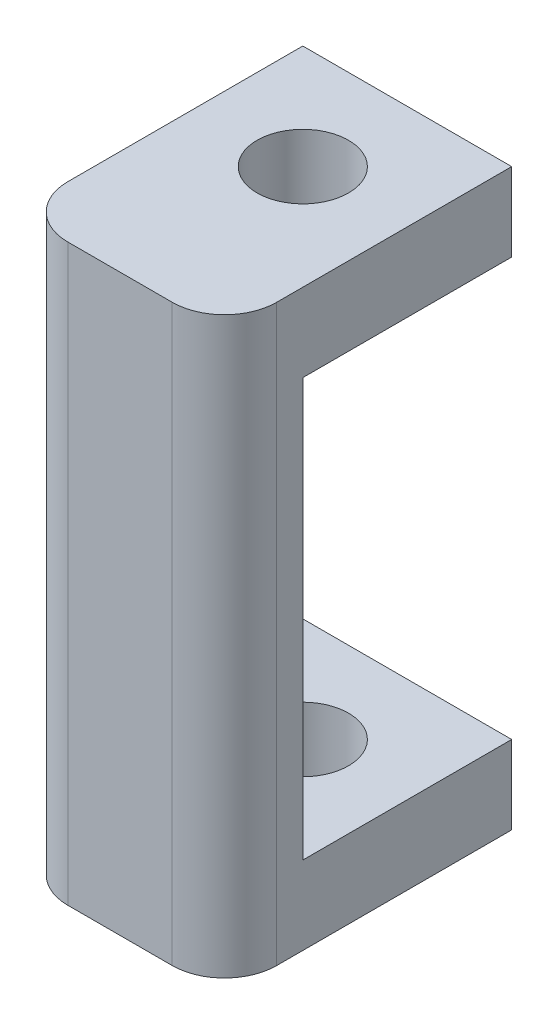
ISO-10303-21;
HEADER;
FILE_DESCRIPTION(('STEP AP214'),'2;1');
FILE_NAME('part.step','',(''),(''),'','','');
FILE_SCHEMA(('AUTOMOTIVE_DESIGN { 1 0 10303 214 1 1 1 1 }'));
ENDSEC;
DATA;
#1=APPLICATION_CONTEXT('core data for automotive mechanical design processes');
#2=APPLICATION_PROTOCOL_DEFINITION('international standard','automotive_design',2000,#1);
#3=PRODUCT_CONTEXT('',#1,'mechanical');
#4=PRODUCT('Part','Part','',(#3));
#5=PRODUCT_RELATED_PRODUCT_CATEGORY('part','',(#4));
#6=PRODUCT_DEFINITION_FORMATION('','',#4);
#7=PRODUCT_DEFINITION_CONTEXT('part definition',#1,'design');
#8=PRODUCT_DEFINITION('design','',#6,#7);
#9=PRODUCT_DEFINITION_SHAPE('','',#8);
#10=(LENGTH_UNIT() NAMED_UNIT(*) SI_UNIT(.MILLI.,.METRE.));
#11=(NAMED_UNIT(*) PLANE_ANGLE_UNIT() SI_UNIT($,.RADIAN.));
#12=(NAMED_UNIT(*) SI_UNIT($,.STERADIAN.) SOLID_ANGLE_UNIT());
#13=UNCERTAINTY_MEASURE_WITH_UNIT(LENGTH_MEASURE(1.E-05),#10,'distance_accuracy_value','');
#14=(GEOMETRIC_REPRESENTATION_CONTEXT(3) GLOBAL_UNCERTAINTY_ASSIGNED_CONTEXT((#13)) GLOBAL_UNIT_ASSIGNED_CONTEXT((#10,
#11,#12)) REPRESENTATION_CONTEXT('',''));
#15=CARTESIAN_POINT('',(0.,0.,0.));
#16=DIRECTION('',(0.,0.,1.));
#17=DIRECTION('',(1.,0.,0.));
#18=AXIS2_PLACEMENT_3D('',#15,#16,#17);
#19=CARTESIAN_POINT('',(0.,3.,0.));
#20=DIRECTION('',(0.,0.,-1.));
#21=DIRECTION('',(-1.,0.,0.));
#22=AXIS2_PLACEMENT_3D('',#19,#20,#21);
#23=PLANE('',#22);
#24=DIRECTION('',(1.,0.,0.));
#25=VECTOR('',#24,1.);
#26=CARTESIAN_POINT('',(0.,0.,0.));
#27=LINE('',#26,#25);
#28=CARTESIAN_POINT('',(0.,0.,0.));
#29=VERTEX_POINT('',#28);
#30=CARTESIAN_POINT('',(8.,0.,0.));
#31=VERTEX_POINT('',#30);
#32=EDGE_CURVE('E85',#29,#31,#27,.T.);
#33=ORIENTED_EDGE('',*,*,#32,.F.);
#34=DIRECTION('',(0.,-1.,0.));
#35=VECTOR('',#34,1.);
#36=CARTESIAN_POINT('',(0.,3.,0.));
#37=LINE('',#36,#35);
#38=CARTESIAN_POINT('',(0.,3.,0.));
#39=VERTEX_POINT('',#38);
#40=EDGE_CURVE('E11',#39,#29,#37,.T.);
#41=ORIENTED_EDGE('',*,*,#40,.F.);
#42=DIRECTION('',(1.,0.,0.));
#43=VECTOR('',#42,1.);
#44=CARTESIAN_POINT('',(0.,3.,0.));
#45=LINE('',#44,#43);
#46=CARTESIAN_POINT('',(8.,3.,0.));
#47=VERTEX_POINT('',#46);
#48=EDGE_CURVE('E88',#39,#47,#45,.T.);
#49=ORIENTED_EDGE('',*,*,#48,.T.);
#50=DIRECTION('',(0.,-1.,0.));
#51=VECTOR('',#50,1.);
#52=CARTESIAN_POINT('',(8.,3.,0.));
#53=LINE('',#52,#51);
#54=EDGE_CURVE('E60',#47,#31,#53,.T.);
#55=ORIENTED_EDGE('',*,*,#54,.T.);
#56=EDGE_LOOP('',(#33,#41,#49,#55));
#57=FACE_BOUND('',#56,.T.);
#58=ADVANCED_FACE('F37',(#57),#23,.T.);
#59=CARTESIAN_POINT('',(0.,3.,0.));
#60=DIRECTION('',(-1.,0.,0.));
#61=DIRECTION('',(0.,0.,1.));
#62=AXIS2_PLACEMENT_3D('',#59,#60,#61);
#63=PLANE('',#62);
#64=DIRECTION('',(0.,0.,-1.));
#65=VECTOR('',#64,1.);
#66=CARTESIAN_POINT('',(0.,0.,0.));
#67=LINE('',#66,#65);
#68=CARTESIAN_POINT('',(0.,0.,8.99999999999999));
#69=VERTEX_POINT('',#68);
#70=EDGE_CURVE('E98',#69,#29,#67,.T.);
#71=ORIENTED_EDGE('',*,*,#70,.F.);
#72=DIRECTION('',(0.,-1.,0.));
#73=VECTOR('',#72,1.);
#74=CARTESIAN_POINT('',(0.,3.,8.99999999999999));
#75=LINE('',#74,#73);
#76=CARTESIAN_POINT('',(0.,22.,8.99999999999999));
#77=VERTEX_POINT('',#76);
#78=EDGE_CURVE('E45',#77,#69,#75,.T.);
#79=ORIENTED_EDGE('',*,*,#78,.F.);
#80=DIRECTION('',(0.,0.,1.));
#81=VECTOR('',#80,1.);
#82=CARTESIAN_POINT('',(0.,22.,8.));
#83=LINE('',#82,#81);
#84=CARTESIAN_POINT('',(0.,22.,0.));
#85=VERTEX_POINT('',#84);
#86=EDGE_CURVE('E153',#85,#77,#83,.T.);
#87=ORIENTED_EDGE('',*,*,#86,.F.);
#88=DIRECTION('',(0.,-1.,0.));
#89=VECTOR('',#88,1.);
#90=CARTESIAN_POINT('',(0.,22.,0.));
#91=LINE('',#90,#89);
#92=CARTESIAN_POINT('',(0.,19.,0.));
#93=VERTEX_POINT('',#92);
#94=EDGE_CURVE('E155',#85,#93,#91,.T.);
#95=ORIENTED_EDGE('',*,*,#94,.T.);
#96=DIRECTION('',(0.,0.,1.));
#97=VECTOR('',#96,1.);
#98=CARTESIAN_POINT('',(0.,19.,8.));
#99=LINE('',#98,#97);
#100=CARTESIAN_POINT('',(0.,19.,8.));
#101=VERTEX_POINT('',#100);
#102=EDGE_CURVE('E168',#93,#101,#99,.T.);
#103=ORIENTED_EDGE('',*,*,#102,.T.);
#104=DIRECTION('',(0.,-1.,0.));
#105=VECTOR('',#104,1.);
#106=CARTESIAN_POINT('',(0.,19.,8.));
#107=LINE('',#106,#105);
#108=CARTESIAN_POINT('',(0.,3.,8.));
#109=VERTEX_POINT('',#108);
#110=EDGE_CURVE('E180',#101,#109,#107,.T.);
#111=ORIENTED_EDGE('',*,*,#110,.T.);
#112=DIRECTION('',(0.,0.,-1.));
#113=VECTOR('',#112,1.);
#114=CARTESIAN_POINT('',(0.,3.,0.));
#115=LINE('',#114,#113);
#116=EDGE_CURVE('E188',#109,#39,#115,.T.);
#117=ORIENTED_EDGE('',*,*,#116,.T.);
#118=ORIENTED_EDGE('',*,*,#40,.T.);
#119=EDGE_LOOP('',(#71,#79,#87,#95,#103,#111,#117,#118));
#120=FACE_BOUND('',#119,.T.);
#121=ADVANCED_FACE('F135',(#120),#63,.T.);
#122=CARTESIAN_POINT('',(2.,3.,9.));
#123=DIRECTION('',(0.,-1.,0.));
#124=DIRECTION('',(0.,0.,-1.));
#125=AXIS2_PLACEMENT_3D('',#122,#123,#124);
#126=CYLINDRICAL_SURFACE('',#125,2.);
#127=CARTESIAN_POINT('',(2.,0.,9.));
#128=DIRECTION('',(0.,1.,0.));
#129=DIRECTION('',(0.,0.,1.));
#130=AXIS2_PLACEMENT_3D('',#127,#128,#129);
#131=CIRCLE('',#130,2.);
#132=CARTESIAN_POINT('',(2.00000000000001,0.,11.));
#133=VERTEX_POINT('',#132);
#134=EDGE_CURVE('E126',#69,#133,#131,.T.);
#135=ORIENTED_EDGE('',*,*,#134,.T.);
#136=DIRECTION('',(0.,-1.,0.));
#137=VECTOR('',#136,1.);
#138=CARTESIAN_POINT('',(2.00000000000001,3.,11.));
#139=LINE('',#138,#137);
#140=CARTESIAN_POINT('',(2.,22.,11.));
#141=VERTEX_POINT('',#140);
#142=EDGE_CURVE('E118',#141,#133,#139,.T.);
#143=ORIENTED_EDGE('',*,*,#142,.F.);
#144=CARTESIAN_POINT('',(2.,22.,9.));
#145=DIRECTION('',(0.,1.,0.));
#146=DIRECTION('',(0.,0.,1.));
#147=AXIS2_PLACEMENT_3D('',#144,#145,#146);
#148=CIRCLE('',#147,2.);
#149=EDGE_CURVE('E129',#77,#141,#148,.T.);
#150=ORIENTED_EDGE('',*,*,#149,.F.);
#151=ORIENTED_EDGE('',*,*,#78,.T.);
#152=EDGE_LOOP('',(#135,#143,#150,#151));
#153=FACE_BOUND('',#152,.T.);
#154=ADVANCED_FACE('F124',(#153),#126,.T.);
#155=CARTESIAN_POINT('',(0.,3.,11.));
#156=DIRECTION('',(0.,0.,-1.));
#157=DIRECTION('',(-1.,0.,0.));
#158=AXIS2_PLACEMENT_3D('',#155,#156,#157);
#159=PLANE('',#158);
#160=DIRECTION('',(1.,0.,0.));
#161=VECTOR('',#160,1.);
#162=CARTESIAN_POINT('',(0.,0.,11.));
#163=LINE('',#162,#161);
#164=CARTESIAN_POINT('',(5.99999999999999,0.,11.));
#165=VERTEX_POINT('',#164);
#166=EDGE_CURVE('E110',#133,#165,#163,.T.);
#167=ORIENTED_EDGE('',*,*,#166,.T.);
#168=DIRECTION('',(0.,-1.,0.));
#169=VECTOR('',#168,1.);
#170=CARTESIAN_POINT('',(5.99999999999999,3.,11.));
#171=LINE('',#170,#169);
#172=CARTESIAN_POINT('',(5.99999999999999,22.,11.));
#173=VERTEX_POINT('',#172);
#174=EDGE_CURVE('E115',#173,#165,#171,.T.);
#175=ORIENTED_EDGE('',*,*,#174,.F.);
#176=DIRECTION('',(1.,0.,0.));
#177=VECTOR('',#176,1.);
#178=CARTESIAN_POINT('',(2.,22.,11.));
#179=LINE('',#178,#177);
#180=EDGE_CURVE('E145',#141,#173,#179,.T.);
#181=ORIENTED_EDGE('',*,*,#180,.F.);
#182=ORIENTED_EDGE('',*,*,#142,.T.);
#183=EDGE_LOOP('',(#167,#175,#181,#182));
#184=FACE_BOUND('',#183,.T.);
#185=ADVANCED_FACE('F140',(#184),#159,.F.);
#186=CARTESIAN_POINT('',(6.,3.,9.));
#187=DIRECTION('',(0.,-1.,0.));
#188=DIRECTION('',(0.,0.,-1.));
#189=AXIS2_PLACEMENT_3D('',#186,#187,#188);
#190=CYLINDRICAL_SURFACE('',#189,2.);
#191=CARTESIAN_POINT('',(6.,0.,9.));
#192=DIRECTION('',(0.,1.,0.));
#193=DIRECTION('',(0.,0.,1.));
#194=AXIS2_PLACEMENT_3D('',#191,#192,#193);
#195=CIRCLE('',#194,2.);
#196=CARTESIAN_POINT('',(8.,0.,8.99999999999999));
#197=VERTEX_POINT('',#196);
#198=EDGE_CURVE('E106',#165,#197,#195,.T.);
#199=ORIENTED_EDGE('',*,*,#198,.T.);
#200=DIRECTION('',(0.,-1.,0.));
#201=VECTOR('',#200,1.);
#202=CARTESIAN_POINT('',(8.,3.,8.99999999999999));
#203=LINE('',#202,#201);
#204=CARTESIAN_POINT('',(8.,22.,8.99999999999999));
#205=VERTEX_POINT('',#204);
#206=EDGE_CURVE('E89',#205,#197,#203,.T.);
#207=ORIENTED_EDGE('',*,*,#206,.F.);
#208=CARTESIAN_POINT('',(6.,22.,9.));
#209=DIRECTION('',(0.,1.,0.));
#210=DIRECTION('',(0.,0.,1.));
#211=AXIS2_PLACEMENT_3D('',#208,#209,#210);
#212=CIRCLE('',#211,2.);
#213=EDGE_CURVE('E171',#173,#205,#212,.T.);
#214=ORIENTED_EDGE('',*,*,#213,.F.);
#215=ORIENTED_EDGE('',*,*,#174,.T.);
#216=EDGE_LOOP('',(#199,#207,#214,#215));
#217=FACE_BOUND('',#216,.T.);
#218=ADVANCED_FACE('F195',(#217),#190,.T.);
#219=CARTESIAN_POINT('',(4.,3.,4.));
#220=DIRECTION('',(0.,-1.,0.));
#221=DIRECTION('',(0.,0.,-1.));
#222=AXIS2_PLACEMENT_3D('',#219,#220,#221);
#223=CYLINDRICAL_SURFACE('',#222,1.75);
#224=CARTESIAN_POINT('',(4.,3.,4.));
#225=DIRECTION('',(0.,1.,0.));
#226=DIRECTION('',(0.,0.,1.));
#227=AXIS2_PLACEMENT_3D('',#224,#225,#226);
#228=CIRCLE('',#227,1.75);
#229=CARTESIAN_POINT('',(4.,3.,5.75));
#230=VERTEX_POINT('',#229);
#231=EDGE_CURVE('E105',#230,#230,#228,.T.);
#232=ORIENTED_EDGE('',*,*,#231,.T.);
#233=EDGE_LOOP('',(#232));
#234=FACE_BOUND('',#233,.T.);
#235=CARTESIAN_POINT('',(4.,0.,4.));
#236=DIRECTION('',(0.,1.,0.));
#237=DIRECTION('',(0.,0.,1.));
#238=AXIS2_PLACEMENT_3D('',#235,#236,#237);
#239=CIRCLE('',#238,1.75);
#240=CARTESIAN_POINT('',(4.,0.,5.75));
#241=VERTEX_POINT('',#240);
#242=EDGE_CURVE('E99',#241,#241,#239,.T.);
#243=ORIENTED_EDGE('',*,*,#242,.F.);
#244=EDGE_LOOP('',(#243));
#245=FACE_BOUND('',#244,.T.);
#246=ADVANCED_FACE('F39',(#234,#245),#223,.F.);
#247=CARTESIAN_POINT('',(8.,3.,0.));
#248=DIRECTION('',(1.,0.,0.));
#249=DIRECTION('',(0.,0.,-1.));
#250=AXIS2_PLACEMENT_3D('',#247,#248,#249);
#251=PLANE('',#250);
#252=DIRECTION('',(0.,0.,1.));
#253=VECTOR('',#252,1.);
#254=CARTESIAN_POINT('',(8.,0.,0.));
#255=LINE('',#254,#253);
#256=EDGE_CURVE('E95',#31,#197,#255,.T.);
#257=ORIENTED_EDGE('',*,*,#256,.F.);
#258=ORIENTED_EDGE('',*,*,#54,.F.);
#259=DIRECTION('',(0.,0.,1.));
#260=VECTOR('',#259,1.);
#261=CARTESIAN_POINT('',(8.,3.,0.));
#262=LINE('',#261,#260);
#263=CARTESIAN_POINT('',(8.,3.,8.));
#264=VERTEX_POINT('',#263);
#265=EDGE_CURVE('E90',#47,#264,#262,.T.);
#266=ORIENTED_EDGE('',*,*,#265,.T.);
#267=DIRECTION('',(0.,-1.,0.));
#268=VECTOR('',#267,1.);
#269=CARTESIAN_POINT('',(8.,19.,8.));
#270=LINE('',#269,#268);
#271=CARTESIAN_POINT('',(8.,19.,8.));
#272=VERTEX_POINT('',#271);
#273=EDGE_CURVE('E184',#272,#264,#270,.T.);
#274=ORIENTED_EDGE('',*,*,#273,.F.);
#275=DIRECTION('',(0.,0.,-1.));
#276=VECTOR('',#275,1.);
#277=CARTESIAN_POINT('',(8.,19.,0.));
#278=LINE('',#277,#276);
#279=CARTESIAN_POINT('',(8.,19.,0.));
#280=VERTEX_POINT('',#279);
#281=EDGE_CURVE('E161',#272,#280,#278,.T.);
#282=ORIENTED_EDGE('',*,*,#281,.T.);
#283=DIRECTION('',(0.,-1.,0.));
#284=VECTOR('',#283,1.);
#285=CARTESIAN_POINT('',(8.,22.,0.));
#286=LINE('',#285,#284);
#287=CARTESIAN_POINT('',(8.,22.,0.));
#288=VERTEX_POINT('',#287);
#289=EDGE_CURVE('E174',#288,#280,#286,.T.);
#290=ORIENTED_EDGE('',*,*,#289,.F.);
#291=DIRECTION('',(0.,0.,-1.));
#292=VECTOR('',#291,1.);
#293=CARTESIAN_POINT('',(8.,22.,8.99999999999999));
#294=LINE('',#293,#292);
#295=EDGE_CURVE('E248',#205,#288,#294,.T.);
#296=ORIENTED_EDGE('',*,*,#295,.F.);
#297=ORIENTED_EDGE('',*,*,#206,.T.);
#298=EDGE_LOOP('',(#257,#258,#266,#274,#282,#290,#296,#297));
#299=FACE_BOUND('',#298,.T.);
#300=ADVANCED_FACE('F101',(#299),#251,.T.);
#301=CARTESIAN_POINT('',(0.,3.,0.));
#302=DIRECTION('',(0.,1.,0.));
#303=DIRECTION('',(0.,0.,1.));
#304=AXIS2_PLACEMENT_3D('',#301,#302,#303);
#305=PLANE('',#304);
#306=DIRECTION('',(-1.,0.,0.));
#307=VECTOR('',#306,1.);
#308=CARTESIAN_POINT('',(8.,3.,8.));
#309=LINE('',#308,#307);
#310=EDGE_CURVE('E52',#264,#109,#309,.T.);
#311=ORIENTED_EDGE('',*,*,#310,.F.);
#312=ORIENTED_EDGE('',*,*,#265,.F.);
#313=ORIENTED_EDGE('',*,*,#48,.F.);
#314=ORIENTED_EDGE('',*,*,#116,.F.);
#315=EDGE_LOOP('',(#311,#312,#313,#314));
#316=FACE_BOUND('',#315,.T.);
#317=ORIENTED_EDGE('',*,*,#231,.F.);
#318=EDGE_LOOP('',(#317));
#319=FACE_BOUND('',#318,.T.);
#320=ADVANCED_FACE('F201',(#316,#319),#305,.T.);
#321=CARTESIAN_POINT('',(0.,0.,0.));
#322=DIRECTION('',(0.,1.,0.));
#323=DIRECTION('',(0.,0.,1.));
#324=AXIS2_PLACEMENT_3D('',#321,#322,#323);
#325=PLANE('',#324);
#326=ORIENTED_EDGE('',*,*,#242,.T.);
#327=EDGE_LOOP('',(#326));
#328=FACE_BOUND('',#327,.T.);
#329=ORIENTED_EDGE('',*,*,#32,.T.);
#330=ORIENTED_EDGE('',*,*,#256,.T.);
#331=ORIENTED_EDGE('',*,*,#198,.F.);
#332=ORIENTED_EDGE('',*,*,#166,.F.);
#333=ORIENTED_EDGE('',*,*,#134,.F.);
#334=ORIENTED_EDGE('',*,*,#70,.T.);
#335=EDGE_LOOP('',(#329,#330,#331,#332,#333,#334));
#336=FACE_BOUND('',#335,.T.);
#337=ADVANCED_FACE('F94',(#328,#336),#325,.F.);
#338=CARTESIAN_POINT('',(8.,19.,8.));
#339=DIRECTION('',(0.,0.,1.));
#340=DIRECTION('',(1.,0.,0.));
#341=AXIS2_PLACEMENT_3D('',#338,#339,#340);
#342=PLANE('',#341);
#343=ORIENTED_EDGE('',*,*,#310,.T.);
#344=ORIENTED_EDGE('',*,*,#110,.F.);
#345=DIRECTION('',(-1.,0.,0.));
#346=VECTOR('',#345,1.);
#347=CARTESIAN_POINT('',(8.,19.,8.));
#348=LINE('',#347,#346);
#349=EDGE_CURVE('E177',#272,#101,#348,.T.);
#350=ORIENTED_EDGE('',*,*,#349,.F.);
#351=ORIENTED_EDGE('',*,*,#273,.T.);
#352=EDGE_LOOP('',(#343,#344,#350,#351));
#353=FACE_BOUND('',#352,.T.);
#354=ADVANCED_FACE('F217',(#353),#342,.F.);
#355=CARTESIAN_POINT('',(6.,19.,9.));
#356=DIRECTION('',(0.,1.,0.));
#357=DIRECTION('',(0.,0.,1.));
#358=AXIS2_PLACEMENT_3D('',#355,#356,#357);
#359=PLANE('',#358);
#360=CARTESIAN_POINT('',(4.,19.,4.));
#361=DIRECTION('',(0.,1.,0.));
#362=DIRECTION('',(0.,0.,1.));
#363=AXIS2_PLACEMENT_3D('',#360,#361,#362);
#364=CIRCLE('',#363,1.75);
#365=CARTESIAN_POINT('',(4.,19.,5.75));
#366=VERTEX_POINT('',#365);
#367=EDGE_CURVE('E243',#366,#366,#364,.T.);
#368=ORIENTED_EDGE('',*,*,#367,.T.);
#369=EDGE_LOOP('',(#368));
#370=FACE_BOUND('',#369,.T.);
#371=ORIENTED_EDGE('',*,*,#281,.F.);
#372=ORIENTED_EDGE('',*,*,#349,.T.);
#373=ORIENTED_EDGE('',*,*,#102,.F.);
#374=DIRECTION('',(-1.,0.,0.));
#375=VECTOR('',#374,1.);
#376=CARTESIAN_POINT('',(0.,19.,0.));
#377=LINE('',#376,#375);
#378=EDGE_CURVE('E164',#280,#93,#377,.T.);
#379=ORIENTED_EDGE('',*,*,#378,.F.);
#380=EDGE_LOOP('',(#371,#372,#373,#379));
#381=FACE_BOUND('',#380,.T.);
#382=ADVANCED_FACE('F222',(#370,#381),#359,.F.);
#383=CARTESIAN_POINT('',(6.,22.,9.));
#384=DIRECTION('',(0.,1.,0.));
#385=DIRECTION('',(0.,0.,1.));
#386=AXIS2_PLACEMENT_3D('',#383,#384,#385);
#387=PLANE('',#386);
#388=ORIENTED_EDGE('',*,*,#213,.T.);
#389=ORIENTED_EDGE('',*,*,#295,.T.);
#390=DIRECTION('',(-1.,0.,0.));
#391=VECTOR('',#390,1.);
#392=CARTESIAN_POINT('',(0.,22.,0.));
#393=LINE('',#392,#391);
#394=EDGE_CURVE('E157',#288,#85,#393,.T.);
#395=ORIENTED_EDGE('',*,*,#394,.T.);
#396=ORIENTED_EDGE('',*,*,#86,.T.);
#397=ORIENTED_EDGE('',*,*,#149,.T.);
#398=ORIENTED_EDGE('',*,*,#180,.T.);
#399=EDGE_LOOP('',(#388,#389,#395,#396,#397,#398));
#400=FACE_BOUND('',#399,.T.);
#401=CARTESIAN_POINT('',(4.,22.,4.));
#402=DIRECTION('',(0.,1.,0.));
#403=DIRECTION('',(0.,0.,1.));
#404=AXIS2_PLACEMENT_3D('',#401,#402,#403);
#405=CIRCLE('',#404,1.75);
#406=CARTESIAN_POINT('',(4.,22.,5.75));
#407=VERTEX_POINT('',#406);
#408=EDGE_CURVE('E165',#407,#407,#405,.T.);
#409=ORIENTED_EDGE('',*,*,#408,.F.);
#410=EDGE_LOOP('',(#409));
#411=FACE_BOUND('',#410,.T.);
#412=ADVANCED_FACE('F149',(#400,#411),#387,.T.);
#413=CARTESIAN_POINT('',(0.,22.,0.));
#414=DIRECTION('',(0.,0.,1.));
#415=DIRECTION('',(1.,0.,0.));
#416=AXIS2_PLACEMENT_3D('',#413,#414,#415);
#417=PLANE('',#416);
#418=ORIENTED_EDGE('',*,*,#378,.T.);
#419=ORIENTED_EDGE('',*,*,#94,.F.);
#420=ORIENTED_EDGE('',*,*,#394,.F.);
#421=ORIENTED_EDGE('',*,*,#289,.T.);
#422=EDGE_LOOP('',(#418,#419,#420,#421));
#423=FACE_BOUND('',#422,.T.);
#424=ADVANCED_FACE('F224',(#423),#417,.F.);
#425=CARTESIAN_POINT('',(4.,22.,4.));
#426=DIRECTION('',(0.,-1.,0.));
#427=DIRECTION('',(0.,0.,-1.));
#428=AXIS2_PLACEMENT_3D('',#425,#426,#427);
#429=CYLINDRICAL_SURFACE('',#428,1.75);
#430=ORIENTED_EDGE('',*,*,#408,.T.);
#431=EDGE_LOOP('',(#430));
#432=FACE_BOUND('',#431,.T.);
#433=ORIENTED_EDGE('',*,*,#367,.F.);
#434=EDGE_LOOP('',(#433));
#435=FACE_BOUND('',#434,.T.);
#436=ADVANCED_FACE('F227',(#432,#435),#429,.F.);
#437=CLOSED_SHELL('',(#58,#121,#154,#185,#218,#246,#300,#320,#337,#354,#382,#412,#424,#436));
#438=MANIFOLD_SOLID_BREP('B2',#437);
#439=ADVANCED_BREP_SHAPE_REPRESENTATION('',(#18,#438),#14);
#440=SHAPE_DEFINITION_REPRESENTATION(#9,#439);
ENDSEC;
END-ISO-10303-21;
